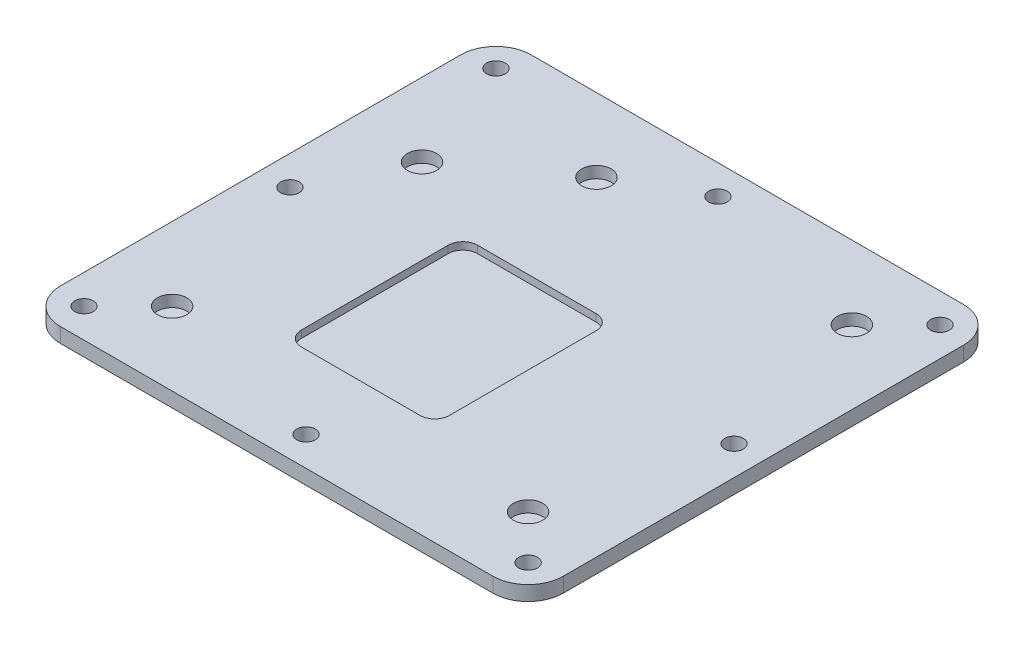
ISO-10303-21;
HEADER;
FILE_DESCRIPTION(('STEP AP214'),'2;1');
FILE_NAME('part.step','',(''),(''),'','','');
FILE_SCHEMA(('AUTOMOTIVE_DESIGN { 1 0 10303 214 1 1 1 1 }'));
ENDSEC;
DATA;
#1=APPLICATION_CONTEXT('core data for automotive mechanical design processes');
#2=APPLICATION_PROTOCOL_DEFINITION('international standard','automotive_design',2000,#1);
#3=PRODUCT_CONTEXT('',#1,'mechanical');
#4=PRODUCT('Part','Part','',(#3));
#5=PRODUCT_RELATED_PRODUCT_CATEGORY('part','',(#4));
#6=PRODUCT_DEFINITION_FORMATION('','',#4);
#7=PRODUCT_DEFINITION_CONTEXT('part definition',#1,'design');
#8=PRODUCT_DEFINITION('design','',#6,#7);
#9=PRODUCT_DEFINITION_SHAPE('','',#8);
#10=(LENGTH_UNIT() NAMED_UNIT(*) SI_UNIT(.MILLI.,.METRE.));
#11=(NAMED_UNIT(*) PLANE_ANGLE_UNIT() SI_UNIT($,.RADIAN.));
#12=(NAMED_UNIT(*) SI_UNIT($,.STERADIAN.) SOLID_ANGLE_UNIT());
#13=UNCERTAINTY_MEASURE_WITH_UNIT(LENGTH_MEASURE(1.E-05),#10,'distance_accuracy_value','');
#14=(GEOMETRIC_REPRESENTATION_CONTEXT(3) GLOBAL_UNCERTAINTY_ASSIGNED_CONTEXT((#13)) GLOBAL_UNIT_ASSIGNED_CONTEXT((#10,
#11,#12)) REPRESENTATION_CONTEXT('',''));
#15=CARTESIAN_POINT('',(0.,0.,0.));
#16=DIRECTION('',(0.,0.,1.));
#17=DIRECTION('',(1.,0.,0.));
#18=AXIS2_PLACEMENT_3D('',#15,#16,#17);
#19=CARTESIAN_POINT('',(0.,0.,0.));
#20=DIRECTION('',(0.,1.,0.));
#21=DIRECTION('',(0.,0.,1.));
#22=AXIS2_PLACEMENT_3D('',#19,#20,#21);
#23=PLANE('',#22);
#24=CARTESIAN_POINT('',(-48.006,0.,-44.5262));
#25=DIRECTION('',(0.,1.,0.));
#26=DIRECTION('',(0.,0.,1.));
#27=AXIS2_PLACEMENT_3D('',#24,#25,#26);
#28=CIRCLE('',#27,2.0193);
#29=CARTESIAN_POINT('',(-48.006,0.,-42.5069));
#30=VERTEX_POINT('',#29);
#31=EDGE_CURVE('E517',#30,#30,#28,.T.);
#32=ORIENTED_EDGE('',*,*,#31,.F.);
#33=EDGE_LOOP('',(#32));
#34=FACE_BOUND('',#33,.T.);
#35=CARTESIAN_POINT('',(48.006,0.,-44.5262));
#36=DIRECTION('',(0.,1.,0.));
#37=DIRECTION('',(0.,0.,1.));
#38=AXIS2_PLACEMENT_3D('',#35,#36,#37);
#39=CIRCLE('',#38,2.0193);
#40=CARTESIAN_POINT('',(48.006,0.,-42.5069));
#41=VERTEX_POINT('',#40);
#42=EDGE_CURVE('E512',#41,#41,#39,.T.);
#43=ORIENTED_EDGE('',*,*,#42,.F.);
#44=EDGE_LOOP('',(#43));
#45=FACE_BOUND('',#44,.T.);
#46=CARTESIAN_POINT('',(48.006,0.,44.5262));
#47=DIRECTION('',(0.,1.,0.));
#48=DIRECTION('',(0.,0.,1.));
#49=AXIS2_PLACEMENT_3D('',#46,#47,#48);
#50=CIRCLE('',#49,2.0193);
#51=CARTESIAN_POINT('',(48.006,0.,46.5455));
#52=VERTEX_POINT('',#51);
#53=EDGE_CURVE('E506',#52,#52,#50,.T.);
#54=ORIENTED_EDGE('',*,*,#53,.F.);
#55=EDGE_LOOP('',(#54));
#56=FACE_BOUND('',#55,.T.);
#57=CARTESIAN_POINT('',(-48.006,0.,44.5262));
#58=DIRECTION('',(0.,1.,0.));
#59=DIRECTION('',(0.,0.,1.));
#60=AXIS2_PLACEMENT_3D('',#57,#58,#59);
#61=CIRCLE('',#60,2.0193);
#62=CARTESIAN_POINT('',(-48.006,0.,46.5455));
#63=VERTEX_POINT('',#62);
#64=EDGE_CURVE('E500',#63,#63,#61,.T.);
#65=ORIENTED_EDGE('',*,*,#64,.F.);
#66=EDGE_LOOP('',(#65));
#67=FACE_BOUND('',#66,.T.);
#68=CARTESIAN_POINT('',(0.,0.,44.5262));
#69=DIRECTION('',(0.,1.,0.));
#70=DIRECTION('',(0.,0.,1.));
#71=AXIS2_PLACEMENT_3D('',#68,#69,#70);
#72=CIRCLE('',#71,2.0193);
#73=CARTESIAN_POINT('',(0.,0.,46.5455));
#74=VERTEX_POINT('',#73);
#75=EDGE_CURVE('E494',#74,#74,#72,.T.);
#76=ORIENTED_EDGE('',*,*,#75,.F.);
#77=EDGE_LOOP('',(#76));
#78=FACE_BOUND('',#77,.T.);
#79=CARTESIAN_POINT('',(-48.006,0.,0.));
#80=DIRECTION('',(0.,1.,0.));
#81=DIRECTION('',(0.,0.,1.));
#82=AXIS2_PLACEMENT_3D('',#79,#80,#81);
#83=CIRCLE('',#82,2.0193);
#84=CARTESIAN_POINT('',(-48.006,0.,2.0193));
#85=VERTEX_POINT('',#84);
#86=EDGE_CURVE('E488',#85,#85,#83,.T.);
#87=ORIENTED_EDGE('',*,*,#86,.F.);
#88=EDGE_LOOP('',(#87));
#89=FACE_BOUND('',#88,.T.);
#90=CARTESIAN_POINT('',(48.006,0.,0.));
#91=DIRECTION('',(0.,1.,0.));
#92=DIRECTION('',(0.,0.,1.));
#93=AXIS2_PLACEMENT_3D('',#90,#91,#92);
#94=CIRCLE('',#93,2.0193);
#95=CARTESIAN_POINT('',(48.006,0.,2.0193));
#96=VERTEX_POINT('',#95);
#97=EDGE_CURVE('E482',#96,#96,#94,.T.);
#98=ORIENTED_EDGE('',*,*,#97,.F.);
#99=EDGE_LOOP('',(#98));
#100=FACE_BOUND('',#99,.T.);
#101=CARTESIAN_POINT('',(0.,0.,-44.5262));
#102=DIRECTION('',(0.,1.,0.));
#103=DIRECTION('',(0.,0.,1.));
#104=AXIS2_PLACEMENT_3D('',#101,#102,#103);
#105=CIRCLE('',#104,2.0193);
#106=CARTESIAN_POINT('',(0.,0.,-42.5069));
#107=VERTEX_POINT('',#106);
#108=EDGE_CURVE('E476',#107,#107,#105,.T.);
#109=ORIENTED_EDGE('',*,*,#108,.F.);
#110=EDGE_LOOP('',(#109));
#111=FACE_BOUND('',#110,.T.);
#112=CARTESIAN_POINT('',(-38.481,0.,35.0012));
#113=DIRECTION('',(0.,1.,0.));
#114=DIRECTION('',(0.,0.,1.));
#115=AXIS2_PLACEMENT_3D('',#112,#113,#114);
#116=CIRCLE('',#115,3.175);
#117=CARTESIAN_POINT('',(-38.481,0.,38.1762));
#118=VERTEX_POINT('',#117);
#119=EDGE_CURVE('E450',#118,#118,#116,.T.);
#120=ORIENTED_EDGE('',*,*,#119,.F.);
#121=EDGE_LOOP('',(#120));
#122=FACE_BOUND('',#121,.T.);
#123=CARTESIAN_POINT('',(38.481,0.,35.0012));
#124=DIRECTION('',(0.,1.,0.));
#125=DIRECTION('',(0.,0.,1.));
#126=AXIS2_PLACEMENT_3D('',#123,#124,#125);
#127=CIRCLE('',#126,3.175);
#128=CARTESIAN_POINT('',(38.481,0.,38.1762));
#129=VERTEX_POINT('',#128);
#130=EDGE_CURVE('E457',#129,#129,#127,.T.);
#131=ORIENTED_EDGE('',*,*,#130,.F.);
#132=EDGE_LOOP('',(#131));
#133=FACE_BOUND('',#132,.T.);
#134=CARTESIAN_POINT('',(38.481,0.,-35.0012));
#135=DIRECTION('',(0.,1.,0.));
#136=DIRECTION('',(0.,0.,1.));
#137=AXIS2_PLACEMENT_3D('',#134,#135,#136);
#138=CIRCLE('',#137,3.175);
#139=CARTESIAN_POINT('',(38.481,0.,-31.8262));
#140=VERTEX_POINT('',#139);
#141=EDGE_CURVE('E463',#140,#140,#138,.T.);
#142=ORIENTED_EDGE('',*,*,#141,.F.);
#143=EDGE_LOOP('',(#142));
#144=FACE_BOUND('',#143,.T.);
#145=CARTESIAN_POINT('',(-16.7386,0.,-35.0012));
#146=DIRECTION('',(0.,1.,0.));
#147=DIRECTION('',(0.,0.,1.));
#148=AXIS2_PLACEMENT_3D('',#145,#146,#147);
#149=CIRCLE('',#148,3.175);
#150=CARTESIAN_POINT('',(-16.7386,0.,-31.8262));
#151=VERTEX_POINT('',#150);
#152=EDGE_CURVE('E469',#151,#151,#149,.T.);
#153=ORIENTED_EDGE('',*,*,#152,.F.);
#154=EDGE_LOOP('',(#153));
#155=FACE_BOUND('',#154,.T.);
#156=CARTESIAN_POINT('',(-38.481,0.,-19.0246));
#157=DIRECTION('',(0.,1.,0.));
#158=DIRECTION('',(0.,0.,1.));
#159=AXIS2_PLACEMENT_3D('',#156,#157,#158);
#160=CIRCLE('',#159,3.175);
#161=CARTESIAN_POINT('',(-38.481,0.,-15.8496));
#162=VERTEX_POINT('',#161);
#163=EDGE_CURVE('E444',#162,#162,#160,.T.);
#164=ORIENTED_EDGE('',*,*,#163,.F.);
#165=EDGE_LOOP('',(#164));
#166=FACE_BOUND('',#165,.T.);
#167=DIRECTION('',(-1.,0.,0.));
#168=VECTOR('',#167,1.);
#169=CARTESIAN_POINT('',(0.,0.,-50.8762));
#170=LINE('',#169,#168);
#171=CARTESIAN_POINT('',(46.736,0.,-50.8762));
#172=VERTEX_POINT('',#171);
#173=CARTESIAN_POINT('',(-46.736,0.,-50.8762));
#174=VERTEX_POINT('',#173);
#175=EDGE_CURVE('E225',#172,#174,#170,.T.);
#176=ORIENTED_EDGE('',*,*,#175,.T.);
#177=CARTESIAN_POINT('',(-46.736,0.,-43.2562));
#178=DIRECTION('',(0.,1.,0.));
#179=DIRECTION('',(0.,0.,1.));
#180=AXIS2_PLACEMENT_3D('',#177,#178,#179);
#181=CIRCLE('',#180,7.62);
#182=CARTESIAN_POINT('',(-54.356,0.,-43.2562));
#183=VERTEX_POINT('',#182);
#184=EDGE_CURVE('E232',#174,#183,#181,.T.);
#185=ORIENTED_EDGE('',*,*,#184,.T.);
#186=DIRECTION('',(0.,0.,-1.));
#187=VECTOR('',#186,1.);
#188=CARTESIAN_POINT('',(-54.356,0.,0.));
#189=LINE('',#188,#187);
#190=CARTESIAN_POINT('',(-54.356,0.,43.2562));
#191=VERTEX_POINT('',#190);
#192=EDGE_CURVE('E243',#191,#183,#189,.T.);
#193=ORIENTED_EDGE('',*,*,#192,.F.);
#194=CARTESIAN_POINT('',(-46.736,0.,43.2562));
#195=DIRECTION('',(0.,1.,0.));
#196=DIRECTION('',(0.,0.,1.));
#197=AXIS2_PLACEMENT_3D('',#194,#195,#196);
#198=CIRCLE('',#197,7.62);
#199=CARTESIAN_POINT('',(-46.736,0.,50.8762));
#200=VERTEX_POINT('',#199);
#201=EDGE_CURVE('E250',#191,#200,#198,.T.);
#202=ORIENTED_EDGE('',*,*,#201,.T.);
#203=DIRECTION('',(-1.,0.,0.));
#204=VECTOR('',#203,1.);
#205=CARTESIAN_POINT('',(0.,0.,50.8762));
#206=LINE('',#205,#204);
#207=CARTESIAN_POINT('',(46.736,0.,50.8762));
#208=VERTEX_POINT('',#207);
#209=EDGE_CURVE('E338',#208,#200,#206,.T.);
#210=ORIENTED_EDGE('',*,*,#209,.F.);
#211=CARTESIAN_POINT('',(46.736,0.,43.2562));
#212=DIRECTION('',(0.,1.,0.));
#213=DIRECTION('',(0.,0.,1.));
#214=AXIS2_PLACEMENT_3D('',#211,#212,#213);
#215=CIRCLE('',#214,7.62);
#216=CARTESIAN_POINT('',(54.356,0.,43.2562));
#217=VERTEX_POINT('',#216);
#218=EDGE_CURVE('E233',#208,#217,#215,.T.);
#219=ORIENTED_EDGE('',*,*,#218,.T.);
#220=DIRECTION('',(0.,0.,-1.));
#221=VECTOR('',#220,1.);
#222=CARTESIAN_POINT('',(54.356,0.,0.));
#223=LINE('',#222,#221);
#224=CARTESIAN_POINT('',(54.356,0.,-43.2562));
#225=VERTEX_POINT('',#224);
#226=EDGE_CURVE('E227',#217,#225,#223,.T.);
#227=ORIENTED_EDGE('',*,*,#226,.T.);
#228=CARTESIAN_POINT('',(46.736,0.,-43.2562));
#229=DIRECTION('',(0.,1.,0.));
#230=DIRECTION('',(0.,0.,1.));
#231=AXIS2_PLACEMENT_3D('',#228,#229,#230);
#232=CIRCLE('',#231,7.62);
#233=EDGE_CURVE('E223',#225,#172,#232,.T.);
#234=ORIENTED_EDGE('',*,*,#233,.T.);
#235=EDGE_LOOP('',(#176,#185,#193,#202,#210,#219,#227,#234));
#236=FACE_BOUND('',#235,.T.);
#237=DIRECTION('',(0.,0.,-1.));
#238=VECTOR('',#237,1.);
#239=CARTESIAN_POINT('',(11.938,0.,0.));
#240=LINE('',#239,#238);
#241=CARTESIAN_POINT('',(11.938,0.,25.4762));
#242=VERTEX_POINT('',#241);
#243=CARTESIAN_POINT('',(11.938,0.,-6.2738));
#244=VERTEX_POINT('',#243);
#245=EDGE_CURVE('E313',#242,#244,#240,.T.);
#246=ORIENTED_EDGE('',*,*,#245,.F.);
#247=CARTESIAN_POINT('',(8.763,0.,25.4762));
#248=DIRECTION('',(0.,1.,0.));
#249=DIRECTION('',(0.,0.,1.));
#250=AXIS2_PLACEMENT_3D('',#247,#248,#249);
#251=CIRCLE('',#250,3.175);
#252=CARTESIAN_POINT('',(8.763,0.,28.6512));
#253=VERTEX_POINT('',#252);
#254=EDGE_CURVE('E119',#242,#253,#251,.F.);
#255=ORIENTED_EDGE('',*,*,#254,.T.);
#256=DIRECTION('',(-1.,0.,0.));
#257=VECTOR('',#256,1.);
#258=CARTESIAN_POINT('',(0.,0.,28.6512));
#259=LINE('',#258,#257);
#260=CARTESIAN_POINT('',(-16.891,0.,28.6512));
#261=VERTEX_POINT('',#260);
#262=EDGE_CURVE('E324',#253,#261,#259,.T.);
#263=ORIENTED_EDGE('',*,*,#262,.T.);
#264=CARTESIAN_POINT('',(-16.891,0.,25.4762));
#265=DIRECTION('',(0.,1.,0.));
#266=DIRECTION('',(0.,0.,1.));
#267=AXIS2_PLACEMENT_3D('',#264,#265,#266);
#268=CIRCLE('',#267,3.175);
#269=CARTESIAN_POINT('',(-20.066,0.,25.4762));
#270=VERTEX_POINT('',#269);
#271=EDGE_CURVE('E12',#261,#270,#268,.F.);
#272=ORIENTED_EDGE('',*,*,#271,.T.);
#273=DIRECTION('',(0.,0.,-1.));
#274=VECTOR('',#273,1.);
#275=CARTESIAN_POINT('',(-20.066,0.,0.));
#276=LINE('',#275,#274);
#277=CARTESIAN_POINT('',(-20.066,0.,-6.2738));
#278=VERTEX_POINT('',#277);
#279=EDGE_CURVE('E346',#270,#278,#276,.T.);
#280=ORIENTED_EDGE('',*,*,#279,.T.);
#281=CARTESIAN_POINT('',(-16.891,0.,-6.2738));
#282=DIRECTION('',(0.,1.,0.));
#283=DIRECTION('',(0.,0.,1.));
#284=AXIS2_PLACEMENT_3D('',#281,#282,#283);
#285=CIRCLE('',#284,3.175);
#286=CARTESIAN_POINT('',(-16.891,0.,-9.4488));
#287=VERTEX_POINT('',#286);
#288=EDGE_CURVE('E308',#278,#287,#285,.F.);
#289=ORIENTED_EDGE('',*,*,#288,.T.);
#290=DIRECTION('',(-1.,0.,0.));
#291=VECTOR('',#290,1.);
#292=CARTESIAN_POINT('',(0.,0.,-9.4488));
#293=LINE('',#292,#291);
#294=CARTESIAN_POINT('',(8.763,0.,-9.4488));
#295=VERTEX_POINT('',#294);
#296=EDGE_CURVE('E315',#295,#287,#293,.T.);
#297=ORIENTED_EDGE('',*,*,#296,.F.);
#298=CARTESIAN_POINT('',(8.763,0.,-6.2738));
#299=DIRECTION('',(0.,1.,0.));
#300=DIRECTION('',(0.,0.,1.));
#301=AXIS2_PLACEMENT_3D('',#298,#299,#300);
#302=CIRCLE('',#301,3.175);
#303=EDGE_CURVE('E310',#295,#244,#302,.F.);
#304=ORIENTED_EDGE('',*,*,#303,.T.);
#305=EDGE_LOOP('',(#246,#255,#263,#272,#280,#289,#297,#304));
#306=FACE_BOUND('',#305,.T.);
#307=ADVANCED_FACE('F111',(#34,#45,#56,#67,#78,#89,#100,#111,#122,#133,#144,#155,#166,#236,
#306),#23,.T.);
#308=CARTESIAN_POINT('',(0.,-3.175,0.));
#309=DIRECTION('',(0.,1.,0.));
#310=DIRECTION('',(0.,0.,1.));
#311=AXIS2_PLACEMENT_3D('',#308,#309,#310);
#312=PLANE('',#311);
#313=CARTESIAN_POINT('',(-48.006,-3.175,-44.5262));
#314=DIRECTION('',(0.,1.,0.));
#315=DIRECTION('',(0.,0.,1.));
#316=AXIS2_PLACEMENT_3D('',#313,#314,#315);
#317=CIRCLE('',#316,2.0193);
#318=CARTESIAN_POINT('',(-48.006,-3.175,-42.5069));
#319=VERTEX_POINT('',#318);
#320=EDGE_CURVE('E515',#319,#319,#317,.T.);
#321=ORIENTED_EDGE('',*,*,#320,.T.);
#322=EDGE_LOOP('',(#321));
#323=FACE_BOUND('',#322,.T.);
#324=CARTESIAN_POINT('',(48.006,-3.175,-44.5262));
#325=DIRECTION('',(0.,1.,0.));
#326=DIRECTION('',(0.,0.,1.));
#327=AXIS2_PLACEMENT_3D('',#324,#325,#326);
#328=CIRCLE('',#327,2.0193);
#329=CARTESIAN_POINT('',(48.006,-3.175,-42.5069));
#330=VERTEX_POINT('',#329);
#331=EDGE_CURVE('E509',#330,#330,#328,.T.);
#332=ORIENTED_EDGE('',*,*,#331,.T.);
#333=EDGE_LOOP('',(#332));
#334=FACE_BOUND('',#333,.T.);
#335=CARTESIAN_POINT('',(48.006,-3.175,44.5262));
#336=DIRECTION('',(0.,1.,0.));
#337=DIRECTION('',(0.,0.,1.));
#338=AXIS2_PLACEMENT_3D('',#335,#336,#337);
#339=CIRCLE('',#338,2.0193);
#340=CARTESIAN_POINT('',(48.006,-3.175,46.5455));
#341=VERTEX_POINT('',#340);
#342=EDGE_CURVE('E503',#341,#341,#339,.T.);
#343=ORIENTED_EDGE('',*,*,#342,.T.);
#344=EDGE_LOOP('',(#343));
#345=FACE_BOUND('',#344,.T.);
#346=CARTESIAN_POINT('',(-48.006,-3.175,44.5262));
#347=DIRECTION('',(0.,1.,0.));
#348=DIRECTION('',(0.,0.,1.));
#349=AXIS2_PLACEMENT_3D('',#346,#347,#348);
#350=CIRCLE('',#349,2.0193);
#351=CARTESIAN_POINT('',(-48.006,-3.175,46.5455));
#352=VERTEX_POINT('',#351);
#353=EDGE_CURVE('E497',#352,#352,#350,.T.);
#354=ORIENTED_EDGE('',*,*,#353,.T.);
#355=EDGE_LOOP('',(#354));
#356=FACE_BOUND('',#355,.T.);
#357=CARTESIAN_POINT('',(0.,-3.175,44.5262));
#358=DIRECTION('',(0.,1.,0.));
#359=DIRECTION('',(0.,0.,1.));
#360=AXIS2_PLACEMENT_3D('',#357,#358,#359);
#361=CIRCLE('',#360,2.0193);
#362=CARTESIAN_POINT('',(0.,-3.175,46.5455));
#363=VERTEX_POINT('',#362);
#364=EDGE_CURVE('E491',#363,#363,#361,.T.);
#365=ORIENTED_EDGE('',*,*,#364,.T.);
#366=EDGE_LOOP('',(#365));
#367=FACE_BOUND('',#366,.T.);
#368=CARTESIAN_POINT('',(-48.006,-3.175,0.));
#369=DIRECTION('',(0.,1.,0.));
#370=DIRECTION('',(0.,0.,1.));
#371=AXIS2_PLACEMENT_3D('',#368,#369,#370);
#372=CIRCLE('',#371,2.0193);
#373=CARTESIAN_POINT('',(-48.006,-3.175,2.0193));
#374=VERTEX_POINT('',#373);
#375=EDGE_CURVE('E485',#374,#374,#372,.T.);
#376=ORIENTED_EDGE('',*,*,#375,.T.);
#377=EDGE_LOOP('',(#376));
#378=FACE_BOUND('',#377,.T.);
#379=CARTESIAN_POINT('',(48.006,-3.175,0.));
#380=DIRECTION('',(0.,1.,0.));
#381=DIRECTION('',(0.,0.,1.));
#382=AXIS2_PLACEMENT_3D('',#379,#380,#381);
#383=CIRCLE('',#382,2.0193);
#384=CARTESIAN_POINT('',(48.006,-3.175,2.0193));
#385=VERTEX_POINT('',#384);
#386=EDGE_CURVE('E479',#385,#385,#383,.T.);
#387=ORIENTED_EDGE('',*,*,#386,.T.);
#388=EDGE_LOOP('',(#387));
#389=FACE_BOUND('',#388,.T.);
#390=CARTESIAN_POINT('',(0.,-3.175,-44.5262));
#391=DIRECTION('',(0.,1.,0.));
#392=DIRECTION('',(0.,0.,1.));
#393=AXIS2_PLACEMENT_3D('',#390,#391,#392);
#394=CIRCLE('',#393,2.0193);
#395=CARTESIAN_POINT('',(0.,-3.175,-42.5069));
#396=VERTEX_POINT('',#395);
#397=EDGE_CURVE('E454',#396,#396,#394,.T.);
#398=ORIENTED_EDGE('',*,*,#397,.T.);
#399=EDGE_LOOP('',(#398));
#400=FACE_BOUND('',#399,.T.);
#401=DIRECTION('',(0.,0.,-1.));
#402=VECTOR('',#401,1.);
#403=CARTESIAN_POINT('',(-54.356,-3.175,0.));
#404=LINE('',#403,#402);
#405=CARTESIAN_POINT('',(-54.356,-3.175,43.2562));
#406=VERTEX_POINT('',#405);
#407=CARTESIAN_POINT('',(-54.356,-3.175,-43.2562));
#408=VERTEX_POINT('',#407);
#409=EDGE_CURVE('E248',#406,#408,#404,.T.);
#410=ORIENTED_EDGE('',*,*,#409,.T.);
#411=CARTESIAN_POINT('',(-46.736,-3.175,-43.2562));
#412=DIRECTION('',(0.,1.,0.));
#413=DIRECTION('',(0.,0.,1.));
#414=AXIS2_PLACEMENT_3D('',#411,#412,#413);
#415=CIRCLE('',#414,7.62);
#416=CARTESIAN_POINT('',(-46.736,-3.175,-50.8762));
#417=VERTEX_POINT('',#416);
#418=EDGE_CURVE('E270',#408,#417,#415,.F.);
#419=ORIENTED_EDGE('',*,*,#418,.T.);
#420=DIRECTION('',(-1.,0.,0.));
#421=VECTOR('',#420,1.);
#422=CARTESIAN_POINT('',(0.,-3.175,-50.8762));
#423=LINE('',#422,#421);
#424=CARTESIAN_POINT('',(46.736,-3.175,-50.8762));
#425=VERTEX_POINT('',#424);
#426=EDGE_CURVE('E253',#425,#417,#423,.T.);
#427=ORIENTED_EDGE('',*,*,#426,.F.);
#428=CARTESIAN_POINT('',(46.736,-3.175,-43.2562));
#429=DIRECTION('',(0.,1.,0.));
#430=DIRECTION('',(0.,0.,1.));
#431=AXIS2_PLACEMENT_3D('',#428,#429,#430);
#432=CIRCLE('',#431,7.62);
#433=CARTESIAN_POINT('',(54.356,-3.175,-43.2562));
#434=VERTEX_POINT('',#433);
#435=EDGE_CURVE('E247',#425,#434,#432,.F.);
#436=ORIENTED_EDGE('',*,*,#435,.T.);
#437=DIRECTION('',(0.,0.,-1.));
#438=VECTOR('',#437,1.);
#439=CARTESIAN_POINT('',(54.356,-3.175,0.));
#440=LINE('',#439,#438);
#441=CARTESIAN_POINT('',(54.356,-3.175,43.2562));
#442=VERTEX_POINT('',#441);
#443=EDGE_CURVE('E356',#442,#434,#440,.T.);
#444=ORIENTED_EDGE('',*,*,#443,.F.);
#445=CARTESIAN_POINT('',(46.736,-3.175,43.2562));
#446=DIRECTION('',(0.,1.,0.));
#447=DIRECTION('',(0.,0.,1.));
#448=AXIS2_PLACEMENT_3D('',#445,#446,#447);
#449=CIRCLE('',#448,7.62);
#450=CARTESIAN_POINT('',(46.736,-3.175,50.8762));
#451=VERTEX_POINT('',#450);
#452=EDGE_CURVE('E267',#442,#451,#449,.F.);
#453=ORIENTED_EDGE('',*,*,#452,.T.);
#454=DIRECTION('',(-1.,0.,0.));
#455=VECTOR('',#454,1.);
#456=CARTESIAN_POINT('',(0.,-3.175,50.8762));
#457=LINE('',#456,#455);
#458=CARTESIAN_POINT('',(-46.736,-3.175,50.8762));
#459=VERTEX_POINT('',#458);
#460=EDGE_CURVE('E353',#451,#459,#457,.T.);
#461=ORIENTED_EDGE('',*,*,#460,.T.);
#462=CARTESIAN_POINT('',(-46.736,-3.175,43.2562));
#463=DIRECTION('',(0.,1.,0.));
#464=DIRECTION('',(0.,0.,1.));
#465=AXIS2_PLACEMENT_3D('',#462,#463,#464);
#466=CIRCLE('',#465,7.62);
#467=EDGE_CURVE('E265',#459,#406,#466,.F.);
#468=ORIENTED_EDGE('',*,*,#467,.T.);
#469=EDGE_LOOP('',(#410,#419,#427,#436,#444,#453,#461,#468));
#470=FACE_BOUND('',#469,.T.);
#471=ADVANCED_FACE('F387',(#323,#334,#345,#356,#367,#378,#389,#400,#470),#312,.F.);
#472=CARTESIAN_POINT('',(-54.356,-3.175,0.));
#473=DIRECTION('',(1.,0.,0.));
#474=DIRECTION('',(0.,0.,-1.));
#475=AXIS2_PLACEMENT_3D('',#472,#473,#474);
#476=PLANE('',#475);
#477=ORIENTED_EDGE('',*,*,#192,.T.);
#478=DIRECTION('',(0.,1.,0.));
#479=VECTOR('',#478,1.);
#480=CARTESIAN_POINT('',(-54.356,-3.175,-43.2562));
#481=LINE('',#480,#479);
#482=EDGE_CURVE('E263',#183,#408,#481,.F.);
#483=ORIENTED_EDGE('',*,*,#482,.T.);
#484=ORIENTED_EDGE('',*,*,#409,.F.);
#485=DIRECTION('',(0.,1.,0.));
#486=VECTOR('',#485,1.);
#487=CARTESIAN_POINT('',(-54.356,-3.175,43.2562));
#488=LINE('',#487,#486);
#489=EDGE_CURVE('E260',#406,#191,#488,.T.);
#490=ORIENTED_EDGE('',*,*,#489,.T.);
#491=EDGE_LOOP('',(#477,#483,#484,#490));
#492=FACE_BOUND('',#491,.T.);
#493=ADVANCED_FACE('F368',(#492),#476,.F.);
#494=CARTESIAN_POINT('',(0.,-3.175,-50.8762));
#495=DIRECTION('',(0.,0.,-1.));
#496=DIRECTION('',(-1.,0.,0.));
#497=AXIS2_PLACEMENT_3D('',#494,#495,#496);
#498=PLANE('',#497);
#499=ORIENTED_EDGE('',*,*,#426,.T.);
#500=DIRECTION('',(0.,1.,0.));
#501=VECTOR('',#500,1.);
#502=CARTESIAN_POINT('',(-46.736,0.,-50.8762));
#503=LINE('',#502,#501);
#504=EDGE_CURVE('E242',#417,#174,#503,.T.);
#505=ORIENTED_EDGE('',*,*,#504,.T.);
#506=ORIENTED_EDGE('',*,*,#175,.F.);
#507=DIRECTION('',(0.,1.,0.));
#508=VECTOR('',#507,1.);
#509=CARTESIAN_POINT('',(46.736,-3.175,-50.8762));
#510=LINE('',#509,#508);
#511=EDGE_CURVE('E239',#172,#425,#510,.F.);
#512=ORIENTED_EDGE('',*,*,#511,.T.);
#513=EDGE_LOOP('',(#499,#505,#506,#512));
#514=FACE_BOUND('',#513,.T.);
#515=ADVANCED_FACE('F238',(#514),#498,.T.);
#516=CARTESIAN_POINT('',(54.356,-3.175,0.));
#517=DIRECTION('',(1.,0.,0.));
#518=DIRECTION('',(0.,0.,-1.));
#519=AXIS2_PLACEMENT_3D('',#516,#517,#518);
#520=PLANE('',#519);
#521=ORIENTED_EDGE('',*,*,#443,.T.);
#522=DIRECTION('',(0.,1.,0.));
#523=VECTOR('',#522,1.);
#524=CARTESIAN_POINT('',(54.356,-3.175,-43.2562));
#525=LINE('',#524,#523);
#526=EDGE_CURVE('E274',#434,#225,#525,.T.);
#527=ORIENTED_EDGE('',*,*,#526,.T.);
#528=ORIENTED_EDGE('',*,*,#226,.F.);
#529=DIRECTION('',(0.,1.,0.));
#530=VECTOR('',#529,1.);
#531=CARTESIAN_POINT('',(54.356,-3.175,43.2562));
#532=LINE('',#531,#530);
#533=EDGE_CURVE('E272',#217,#442,#532,.F.);
#534=ORIENTED_EDGE('',*,*,#533,.T.);
#535=EDGE_LOOP('',(#521,#527,#528,#534));
#536=FACE_BOUND('',#535,.T.);
#537=ADVANCED_FACE('F385',(#536),#520,.T.);
#538=CARTESIAN_POINT('',(0.,-3.175,50.8762));
#539=DIRECTION('',(0.,0.,-1.));
#540=DIRECTION('',(-1.,0.,0.));
#541=AXIS2_PLACEMENT_3D('',#538,#539,#540);
#542=PLANE('',#541);
#543=ORIENTED_EDGE('',*,*,#460,.F.);
#544=DIRECTION('',(0.,1.,0.));
#545=VECTOR('',#544,1.);
#546=CARTESIAN_POINT('',(46.736,0.,50.8762));
#547=LINE('',#546,#545);
#548=EDGE_CURVE('E278',#451,#208,#547,.T.);
#549=ORIENTED_EDGE('',*,*,#548,.T.);
#550=ORIENTED_EDGE('',*,*,#209,.T.);
#551=DIRECTION('',(0.,1.,0.));
#552=VECTOR('',#551,1.);
#553=CARTESIAN_POINT('',(-46.736,-3.175,50.8762));
#554=LINE('',#553,#552);
#555=EDGE_CURVE('E276',#200,#459,#554,.F.);
#556=ORIENTED_EDGE('',*,*,#555,.T.);
#557=EDGE_LOOP('',(#543,#549,#550,#556));
#558=FACE_BOUND('',#557,.T.);
#559=ADVANCED_FACE('F378',(#558),#542,.F.);
#560=CARTESIAN_POINT('',(-20.066,-1.5875,0.));
#561=DIRECTION('',(1.,0.,0.));
#562=DIRECTION('',(0.,0.,-1.));
#563=AXIS2_PLACEMENT_3D('',#560,#561,#562);
#564=PLANE('',#563);
#565=DIRECTION('',(0.,0.,-1.));
#566=VECTOR('',#565,1.);
#567=CARTESIAN_POINT('',(-20.066,-1.5875,0.));
#568=LINE('',#567,#566);
#569=CARTESIAN_POINT('',(-20.066,-1.5875,25.4762));
#570=VERTEX_POINT('',#569);
#571=CARTESIAN_POINT('',(-20.066,-1.5875,-6.2738));
#572=VERTEX_POINT('',#571);
#573=EDGE_CURVE('E352',#570,#572,#568,.T.);
#574=ORIENTED_EDGE('',*,*,#573,.T.);
#575=DIRECTION('',(0.,1.,0.));
#576=VECTOR('',#575,1.);
#577=CARTESIAN_POINT('',(-20.066,-1.5875,-6.2738));
#578=LINE('',#577,#576);
#579=EDGE_CURVE('E283',#572,#278,#578,.T.);
#580=ORIENTED_EDGE('',*,*,#579,.T.);
#581=ORIENTED_EDGE('',*,*,#279,.F.);
#582=DIRECTION('',(0.,1.,0.));
#583=VECTOR('',#582,1.);
#584=CARTESIAN_POINT('',(-20.066,-1.5875,25.4762));
#585=LINE('',#584,#583);
#586=EDGE_CURVE('E281',#270,#570,#585,.F.);
#587=ORIENTED_EDGE('',*,*,#586,.T.);
#588=EDGE_LOOP('',(#574,#580,#581,#587));
#589=FACE_BOUND('',#588,.T.);
#590=ADVANCED_FACE('F391',(#589),#564,.T.);
#591=CARTESIAN_POINT('',(0.,-1.5875,-9.4488));
#592=DIRECTION('',(0.,0.,-1.));
#593=DIRECTION('',(-1.,0.,0.));
#594=AXIS2_PLACEMENT_3D('',#591,#592,#593);
#595=PLANE('',#594);
#596=ORIENTED_EDGE('',*,*,#296,.T.);
#597=DIRECTION('',(0.,1.,0.));
#598=VECTOR('',#597,1.);
#599=CARTESIAN_POINT('',(-16.891,-1.5875,-9.4488));
#600=LINE('',#599,#598);
#601=CARTESIAN_POINT('',(-16.891,-1.5875,-9.4488));
#602=VERTEX_POINT('',#601);
#603=EDGE_CURVE('E289',#287,#602,#600,.F.);
#604=ORIENTED_EDGE('',*,*,#603,.T.);
#605=DIRECTION('',(-1.,0.,0.));
#606=VECTOR('',#605,1.);
#607=CARTESIAN_POINT('',(0.,-1.5875,-9.4488));
#608=LINE('',#607,#606);
#609=CARTESIAN_POINT('',(8.763,-1.5875,-9.4488));
#610=VERTEX_POINT('',#609);
#611=EDGE_CURVE('E332',#610,#602,#608,.T.);
#612=ORIENTED_EDGE('',*,*,#611,.F.);
#613=DIRECTION('',(0.,1.,0.));
#614=VECTOR('',#613,1.);
#615=CARTESIAN_POINT('',(8.763,0.,-9.4488));
#616=LINE('',#615,#614);
#617=EDGE_CURVE('E286',#610,#295,#616,.T.);
#618=ORIENTED_EDGE('',*,*,#617,.T.);
#619=EDGE_LOOP('',(#596,#604,#612,#618));
#620=FACE_BOUND('',#619,.T.);
#621=ADVANCED_FACE('F336',(#620),#595,.F.);
#622=CARTESIAN_POINT('',(11.938,-1.5875,0.));
#623=DIRECTION('',(1.,0.,0.));
#624=DIRECTION('',(0.,0.,-1.));
#625=AXIS2_PLACEMENT_3D('',#622,#623,#624);
#626=PLANE('',#625);
#627=ORIENTED_EDGE('',*,*,#245,.T.);
#628=DIRECTION('',(0.,1.,0.));
#629=VECTOR('',#628,1.);
#630=CARTESIAN_POINT('',(11.938,-1.5875,-6.2738));
#631=LINE('',#630,#629);
#632=CARTESIAN_POINT('',(11.938,-1.5875,-6.2738));
#633=VERTEX_POINT('',#632);
#634=EDGE_CURVE('E302',#244,#633,#631,.F.);
#635=ORIENTED_EDGE('',*,*,#634,.T.);
#636=DIRECTION('',(0.,0.,-1.));
#637=VECTOR('',#636,1.);
#638=CARTESIAN_POINT('',(11.938,-1.5875,0.));
#639=LINE('',#638,#637);
#640=CARTESIAN_POINT('',(11.938,-1.5875,25.4762));
#641=VERTEX_POINT('',#640);
#642=EDGE_CURVE('E334',#641,#633,#639,.T.);
#643=ORIENTED_EDGE('',*,*,#642,.F.);
#644=DIRECTION('',(0.,1.,0.));
#645=VECTOR('',#644,1.);
#646=CARTESIAN_POINT('',(11.938,-1.5875,25.4762));
#647=LINE('',#646,#645);
#648=EDGE_CURVE('E299',#641,#242,#647,.T.);
#649=ORIENTED_EDGE('',*,*,#648,.T.);
#650=EDGE_LOOP('',(#627,#635,#643,#649));
#651=FACE_BOUND('',#650,.T.);
#652=ADVANCED_FACE('F320',(#651),#626,.F.);
#653=CARTESIAN_POINT('',(0.,-1.5875,28.6512));
#654=DIRECTION('',(0.,0.,-1.));
#655=DIRECTION('',(-1.,0.,0.));
#656=AXIS2_PLACEMENT_3D('',#653,#654,#655);
#657=PLANE('',#656);
#658=ORIENTED_EDGE('',*,*,#262,.F.);
#659=DIRECTION('',(0.,1.,0.));
#660=VECTOR('',#659,1.);
#661=CARTESIAN_POINT('',(8.763,-1.5875,28.6512));
#662=LINE('',#661,#660);
#663=CARTESIAN_POINT('',(8.763,-1.5875,28.6512));
#664=VERTEX_POINT('',#663);
#665=EDGE_CURVE('E306',#253,#664,#662,.F.);
#666=ORIENTED_EDGE('',*,*,#665,.T.);
#667=DIRECTION('',(-1.,0.,0.));
#668=VECTOR('',#667,1.);
#669=CARTESIAN_POINT('',(0.,-1.5875,28.6512));
#670=LINE('',#669,#668);
#671=CARTESIAN_POINT('',(-16.891,-1.5875,28.6512));
#672=VERTEX_POINT('',#671);
#673=EDGE_CURVE('E342',#664,#672,#670,.T.);
#674=ORIENTED_EDGE('',*,*,#673,.T.);
#675=DIRECTION('',(0.,1.,0.));
#676=VECTOR('',#675,1.);
#677=CARTESIAN_POINT('',(-16.891,0.,28.6512));
#678=LINE('',#677,#676);
#679=EDGE_CURVE('E304',#672,#261,#678,.T.);
#680=ORIENTED_EDGE('',*,*,#679,.T.);
#681=EDGE_LOOP('',(#658,#666,#674,#680));
#682=FACE_BOUND('',#681,.T.);
#683=ADVANCED_FACE('F558',(#682),#657,.T.);
#684=CARTESIAN_POINT('',(0.,-1.5875,0.));
#685=DIRECTION('',(0.,1.,0.));
#686=DIRECTION('',(0.,0.,1.));
#687=AXIS2_PLACEMENT_3D('',#684,#685,#686);
#688=PLANE('',#687);
#689=ORIENTED_EDGE('',*,*,#611,.T.);
#690=CARTESIAN_POINT('',(-16.891,-1.5875,-6.2738));
#691=DIRECTION('',(0.,1.,0.));
#692=DIRECTION('',(0.,0.,1.));
#693=AXIS2_PLACEMENT_3D('',#690,#691,#692);
#694=CIRCLE('',#693,3.175);
#695=EDGE_CURVE('E297',#602,#572,#694,.T.);
#696=ORIENTED_EDGE('',*,*,#695,.T.);
#697=ORIENTED_EDGE('',*,*,#573,.F.);
#698=CARTESIAN_POINT('',(-16.891,-1.5875,25.4762));
#699=DIRECTION('',(0.,1.,0.));
#700=DIRECTION('',(0.,0.,1.));
#701=AXIS2_PLACEMENT_3D('',#698,#699,#700);
#702=CIRCLE('',#701,3.175);
#703=EDGE_CURVE('E291',#570,#672,#702,.T.);
#704=ORIENTED_EDGE('',*,*,#703,.T.);
#705=ORIENTED_EDGE('',*,*,#673,.F.);
#706=CARTESIAN_POINT('',(8.763,-1.5875,25.4762));
#707=DIRECTION('',(0.,1.,0.));
#708=DIRECTION('',(0.,0.,1.));
#709=AXIS2_PLACEMENT_3D('',#706,#707,#708);
#710=CIRCLE('',#709,3.175);
#711=EDGE_CURVE('E293',#664,#641,#710,.T.);
#712=ORIENTED_EDGE('',*,*,#711,.T.);
#713=ORIENTED_EDGE('',*,*,#642,.T.);
#714=CARTESIAN_POINT('',(8.763,-1.5875,-6.2738));
#715=DIRECTION('',(0.,1.,0.));
#716=DIRECTION('',(0.,0.,1.));
#717=AXIS2_PLACEMENT_3D('',#714,#715,#716);
#718=CIRCLE('',#717,3.175);
#719=EDGE_CURVE('E295',#633,#610,#718,.T.);
#720=ORIENTED_EDGE('',*,*,#719,.T.);
#721=EDGE_LOOP('',(#689,#696,#697,#704,#705,#712,#713,#720));
#722=FACE_BOUND('',#721,.T.);
#723=ADVANCED_FACE('F331',(#722),#688,.T.);
#724=CARTESIAN_POINT('',(-38.481,-2.5,-19.0246));
#725=DIRECTION('',(0.,1.,0.));
#726=DIRECTION('',(0.,0.,1.));
#727=AXIS2_PLACEMENT_3D('',#724,#725,#726);
#728=CYLINDRICAL_SURFACE('',#727,3.175);
#729=CARTESIAN_POINT('',(-38.481,-2.5,-19.0246));
#730=DIRECTION('',(0.,1.,0.));
#731=DIRECTION('',(0.,0.,1.));
#732=AXIS2_PLACEMENT_3D('',#729,#730,#731);
#733=CIRCLE('',#732,3.175);
#734=CARTESIAN_POINT('',(-38.481,-2.5,-15.8496));
#735=VERTEX_POINT('',#734);
#736=EDGE_CURVE('E349',#735,#735,#733,.T.);
#737=ORIENTED_EDGE('',*,*,#736,.F.);
#738=EDGE_LOOP('',(#737));
#739=FACE_BOUND('',#738,.T.);
#740=ORIENTED_EDGE('',*,*,#163,.T.);
#741=EDGE_LOOP('',(#740));
#742=FACE_BOUND('',#741,.T.);
#743=ADVANCED_FACE('F546',(#739,#742),#728,.F.);
#744=CARTESIAN_POINT('',(-38.481,-2.5,-19.0246));
#745=DIRECTION('',(0.,1.,0.));
#746=DIRECTION('',(0.,0.,1.));
#747=AXIS2_PLACEMENT_3D('',#744,#745,#746);
#748=PLANE('',#747);
#749=ORIENTED_EDGE('',*,*,#736,.T.);
#750=EDGE_LOOP('',(#749));
#751=FACE_BOUND('',#750,.T.);
#752=ADVANCED_FACE('F548',(#751),#748,.T.);
#753=CARTESIAN_POINT('',(-16.7386,-2.5,-35.0012));
#754=DIRECTION('',(0.,1.,0.));
#755=DIRECTION('',(0.,0.,1.));
#756=AXIS2_PLACEMENT_3D('',#753,#754,#755);
#757=CYLINDRICAL_SURFACE('',#756,3.175);
#758=CARTESIAN_POINT('',(-16.7386,-2.5,-35.0012));
#759=DIRECTION('',(0.,1.,0.));
#760=DIRECTION('',(0.,0.,1.));
#761=AXIS2_PLACEMENT_3D('',#758,#759,#760);
#762=CIRCLE('',#761,3.175);
#763=CARTESIAN_POINT('',(-16.7386,-2.5,-31.8262));
#764=VERTEX_POINT('',#763);
#765=EDGE_CURVE('E447',#764,#764,#762,.T.);
#766=ORIENTED_EDGE('',*,*,#765,.F.);
#767=EDGE_LOOP('',(#766));
#768=FACE_BOUND('',#767,.T.);
#769=ORIENTED_EDGE('',*,*,#152,.T.);
#770=EDGE_LOOP('',(#769));
#771=FACE_BOUND('',#770,.T.);
#772=ADVANCED_FACE('F555',(#768,#771),#757,.F.);
#773=CARTESIAN_POINT('',(-16.7386,-2.5,-35.0012));
#774=DIRECTION('',(0.,1.,0.));
#775=DIRECTION('',(0.,0.,1.));
#776=AXIS2_PLACEMENT_3D('',#773,#774,#775);
#777=PLANE('',#776);
#778=ORIENTED_EDGE('',*,*,#765,.T.);
#779=EDGE_LOOP('',(#778));
#780=FACE_BOUND('',#779,.T.);
#781=ADVANCED_FACE('F729',(#780),#777,.T.);
#782=CARTESIAN_POINT('',(38.481,-2.5,-35.0012));
#783=DIRECTION('',(0.,1.,0.));
#784=DIRECTION('',(0.,0.,1.));
#785=AXIS2_PLACEMENT_3D('',#782,#783,#784);
#786=CYLINDRICAL_SURFACE('',#785,3.175);
#787=CARTESIAN_POINT('',(38.481,-2.5,-35.0012));
#788=DIRECTION('',(0.,1.,0.));
#789=DIRECTION('',(0.,0.,1.));
#790=AXIS2_PLACEMENT_3D('',#787,#788,#789);
#791=CIRCLE('',#790,3.175);
#792=CARTESIAN_POINT('',(38.481,-2.5,-31.8262));
#793=VERTEX_POINT('',#792);
#794=EDGE_CURVE('E466',#793,#793,#791,.T.);
#795=ORIENTED_EDGE('',*,*,#794,.F.);
#796=EDGE_LOOP('',(#795));
#797=FACE_BOUND('',#796,.T.);
#798=ORIENTED_EDGE('',*,*,#141,.T.);
#799=EDGE_LOOP('',(#798));
#800=FACE_BOUND('',#799,.T.);
#801=ADVANCED_FACE('F721',(#797,#800),#786,.F.);
#802=CARTESIAN_POINT('',(38.481,-2.5,-35.0012));
#803=DIRECTION('',(0.,1.,0.));
#804=DIRECTION('',(0.,0.,1.));
#805=AXIS2_PLACEMENT_3D('',#802,#803,#804);
#806=PLANE('',#805);
#807=ORIENTED_EDGE('',*,*,#794,.T.);
#808=EDGE_LOOP('',(#807));
#809=FACE_BOUND('',#808,.T.);
#810=ADVANCED_FACE('F713',(#809),#806,.T.);
#811=CARTESIAN_POINT('',(38.481,-2.5,35.0012));
#812=DIRECTION('',(0.,1.,0.));
#813=DIRECTION('',(0.,0.,1.));
#814=AXIS2_PLACEMENT_3D('',#811,#812,#813);
#815=CYLINDRICAL_SURFACE('',#814,3.175);
#816=CARTESIAN_POINT('',(38.481,-2.5,35.0012));
#817=DIRECTION('',(0.,1.,0.));
#818=DIRECTION('',(0.,0.,1.));
#819=AXIS2_PLACEMENT_3D('',#816,#817,#818);
#820=CIRCLE('',#819,3.175);
#821=CARTESIAN_POINT('',(38.481,-2.5,38.1762));
#822=VERTEX_POINT('',#821);
#823=EDGE_CURVE('E460',#822,#822,#820,.T.);
#824=ORIENTED_EDGE('',*,*,#823,.F.);
#825=EDGE_LOOP('',(#824));
#826=FACE_BOUND('',#825,.T.);
#827=ORIENTED_EDGE('',*,*,#130,.T.);
#828=EDGE_LOOP('',(#827));
#829=FACE_BOUND('',#828,.T.);
#830=ADVANCED_FACE('F705',(#826,#829),#815,.F.);
#831=CARTESIAN_POINT('',(38.481,-2.5,35.0012));
#832=DIRECTION('',(0.,1.,0.));
#833=DIRECTION('',(0.,0.,1.));
#834=AXIS2_PLACEMENT_3D('',#831,#832,#833);
#835=PLANE('',#834);
#836=ORIENTED_EDGE('',*,*,#823,.T.);
#837=EDGE_LOOP('',(#836));
#838=FACE_BOUND('',#837,.T.);
#839=ADVANCED_FACE('F698',(#838),#835,.T.);
#840=CARTESIAN_POINT('',(-38.481,-2.5,35.0012));
#841=DIRECTION('',(0.,1.,0.));
#842=DIRECTION('',(0.,0.,1.));
#843=AXIS2_PLACEMENT_3D('',#840,#841,#842);
#844=CYLINDRICAL_SURFACE('',#843,3.175);
#845=CARTESIAN_POINT('',(-38.481,-2.5,35.0012));
#846=DIRECTION('',(0.,1.,0.));
#847=DIRECTION('',(0.,0.,1.));
#848=AXIS2_PLACEMENT_3D('',#845,#846,#847);
#849=CIRCLE('',#848,3.175);
#850=CARTESIAN_POINT('',(-38.481,-2.5,38.1762));
#851=VERTEX_POINT('',#850);
#852=EDGE_CURVE('E453',#851,#851,#849,.T.);
#853=ORIENTED_EDGE('',*,*,#852,.F.);
#854=EDGE_LOOP('',(#853));
#855=FACE_BOUND('',#854,.T.);
#856=ORIENTED_EDGE('',*,*,#119,.T.);
#857=EDGE_LOOP('',(#856));
#858=FACE_BOUND('',#857,.T.);
#859=ADVANCED_FACE('F689',(#855,#858),#844,.F.);
#860=CARTESIAN_POINT('',(-38.481,-2.5,35.0012));
#861=DIRECTION('',(0.,1.,0.));
#862=DIRECTION('',(0.,0.,1.));
#863=AXIS2_PLACEMENT_3D('',#860,#861,#862);
#864=PLANE('',#863);
#865=ORIENTED_EDGE('',*,*,#852,.T.);
#866=EDGE_LOOP('',(#865));
#867=FACE_BOUND('',#866,.T.);
#868=ADVANCED_FACE('F414',(#867),#864,.T.);
#869=CARTESIAN_POINT('',(-46.736,-3.175,-43.2562));
#870=DIRECTION('',(0.,-1.,0.));
#871=DIRECTION('',(0.,0.,-1.));
#872=AXIS2_PLACEMENT_3D('',#869,#870,#871);
#873=CYLINDRICAL_SURFACE('',#872,7.62);
#874=ORIENTED_EDGE('',*,*,#418,.F.);
#875=ORIENTED_EDGE('',*,*,#482,.F.);
#876=ORIENTED_EDGE('',*,*,#184,.F.);
#877=ORIENTED_EDGE('',*,*,#504,.F.);
#878=EDGE_LOOP('',(#874,#875,#876,#877));
#879=FACE_BOUND('',#878,.T.);
#880=ADVANCED_FACE('F363',(#879),#873,.T.);
#881=CARTESIAN_POINT('',(46.736,-3.175,-43.2562));
#882=DIRECTION('',(0.,1.,0.));
#883=DIRECTION('',(0.,0.,1.));
#884=AXIS2_PLACEMENT_3D('',#881,#882,#883);
#885=CYLINDRICAL_SURFACE('',#884,7.62);
#886=ORIENTED_EDGE('',*,*,#435,.F.);
#887=ORIENTED_EDGE('',*,*,#511,.F.);
#888=ORIENTED_EDGE('',*,*,#233,.F.);
#889=ORIENTED_EDGE('',*,*,#526,.F.);
#890=EDGE_LOOP('',(#886,#887,#888,#889));
#891=FACE_BOUND('',#890,.T.);
#892=ADVANCED_FACE('F246',(#891),#885,.T.);
#893=CARTESIAN_POINT('',(46.736,-3.175,43.2562));
#894=DIRECTION('',(0.,-1.,0.));
#895=DIRECTION('',(0.,0.,-1.));
#896=AXIS2_PLACEMENT_3D('',#893,#894,#895);
#897=CYLINDRICAL_SURFACE('',#896,7.62);
#898=ORIENTED_EDGE('',*,*,#452,.F.);
#899=ORIENTED_EDGE('',*,*,#533,.F.);
#900=ORIENTED_EDGE('',*,*,#218,.F.);
#901=ORIENTED_EDGE('',*,*,#548,.F.);
#902=EDGE_LOOP('',(#898,#899,#900,#901));
#903=FACE_BOUND('',#902,.T.);
#904=ADVANCED_FACE('F382',(#903),#897,.T.);
#905=CARTESIAN_POINT('',(-46.736,-3.175,43.2562));
#906=DIRECTION('',(0.,1.,0.));
#907=DIRECTION('',(0.,0.,1.));
#908=AXIS2_PLACEMENT_3D('',#905,#906,#907);
#909=CYLINDRICAL_SURFACE('',#908,7.62);
#910=ORIENTED_EDGE('',*,*,#467,.F.);
#911=ORIENTED_EDGE('',*,*,#555,.F.);
#912=ORIENTED_EDGE('',*,*,#201,.F.);
#913=ORIENTED_EDGE('',*,*,#489,.F.);
#914=EDGE_LOOP('',(#910,#911,#912,#913));
#915=FACE_BOUND('',#914,.T.);
#916=ADVANCED_FACE('F373',(#915),#909,.T.);
#917=CARTESIAN_POINT('',(0.,0.,-44.5262));
#918=DIRECTION('',(0.,1.,0.));
#919=DIRECTION('',(0.,0.,1.));
#920=AXIS2_PLACEMENT_3D('',#917,#918,#919);
#921=CYLINDRICAL_SURFACE('',#920,2.0193);
#922=ORIENTED_EDGE('',*,*,#397,.F.);
#923=EDGE_LOOP('',(#922));
#924=FACE_BOUND('',#923,.T.);
#925=ORIENTED_EDGE('',*,*,#108,.T.);
#926=EDGE_LOOP('',(#925));
#927=FACE_BOUND('',#926,.T.);
#928=ADVANCED_FACE('F421',(#924,#927),#921,.F.);
#929=CARTESIAN_POINT('',(48.006,0.,0.));
#930=DIRECTION('',(0.,1.,0.));
#931=DIRECTION('',(0.,0.,1.));
#932=AXIS2_PLACEMENT_3D('',#929,#930,#931);
#933=CYLINDRICAL_SURFACE('',#932,2.0193);
#934=ORIENTED_EDGE('',*,*,#386,.F.);
#935=EDGE_LOOP('',(#934));
#936=FACE_BOUND('',#935,.T.);
#937=ORIENTED_EDGE('',*,*,#97,.T.);
#938=EDGE_LOOP('',(#937));
#939=FACE_BOUND('',#938,.T.);
#940=ADVANCED_FACE('F650',(#936,#939),#933,.F.);
#941=CARTESIAN_POINT('',(-48.006,0.,0.));
#942=DIRECTION('',(0.,1.,0.));
#943=DIRECTION('',(0.,0.,1.));
#944=AXIS2_PLACEMENT_3D('',#941,#942,#943);
#945=CYLINDRICAL_SURFACE('',#944,2.0193);
#946=ORIENTED_EDGE('',*,*,#375,.F.);
#947=EDGE_LOOP('',(#946));
#948=FACE_BOUND('',#947,.T.);
#949=ORIENTED_EDGE('',*,*,#86,.T.);
#950=EDGE_LOOP('',(#949));
#951=FACE_BOUND('',#950,.T.);
#952=ADVANCED_FACE('F642',(#948,#951),#945,.F.);
#953=CARTESIAN_POINT('',(0.,0.,44.5262));
#954=DIRECTION('',(0.,1.,0.));
#955=DIRECTION('',(0.,0.,1.));
#956=AXIS2_PLACEMENT_3D('',#953,#954,#955);
#957=CYLINDRICAL_SURFACE('',#956,2.0193);
#958=ORIENTED_EDGE('',*,*,#364,.F.);
#959=EDGE_LOOP('',(#958));
#960=FACE_BOUND('',#959,.T.);
#961=ORIENTED_EDGE('',*,*,#75,.T.);
#962=EDGE_LOOP('',(#961));
#963=FACE_BOUND('',#962,.T.);
#964=ADVANCED_FACE('F634',(#960,#963),#957,.F.);
#965=CARTESIAN_POINT('',(-48.006,0.,44.5262));
#966=DIRECTION('',(0.,1.,0.));
#967=DIRECTION('',(0.,0.,1.));
#968=AXIS2_PLACEMENT_3D('',#965,#966,#967);
#969=CYLINDRICAL_SURFACE('',#968,2.0193);
#970=ORIENTED_EDGE('',*,*,#353,.F.);
#971=EDGE_LOOP('',(#970));
#972=FACE_BOUND('',#971,.T.);
#973=ORIENTED_EDGE('',*,*,#64,.T.);
#974=EDGE_LOOP('',(#973));
#975=FACE_BOUND('',#974,.T.);
#976=ADVANCED_FACE('F626',(#972,#975),#969,.F.);
#977=CARTESIAN_POINT('',(48.006,0.,44.5262));
#978=DIRECTION('',(0.,1.,0.));
#979=DIRECTION('',(0.,0.,1.));
#980=AXIS2_PLACEMENT_3D('',#977,#978,#979);
#981=CYLINDRICAL_SURFACE('',#980,2.0193);
#982=ORIENTED_EDGE('',*,*,#342,.F.);
#983=EDGE_LOOP('',(#982));
#984=FACE_BOUND('',#983,.T.);
#985=ORIENTED_EDGE('',*,*,#53,.T.);
#986=EDGE_LOOP('',(#985));
#987=FACE_BOUND('',#986,.T.);
#988=ADVANCED_FACE('F618',(#984,#987),#981,.F.);
#989=CARTESIAN_POINT('',(48.006,0.,-44.5262));
#990=DIRECTION('',(0.,1.,0.));
#991=DIRECTION('',(0.,0.,1.));
#992=AXIS2_PLACEMENT_3D('',#989,#990,#991);
#993=CYLINDRICAL_SURFACE('',#992,2.0193);
#994=ORIENTED_EDGE('',*,*,#331,.F.);
#995=EDGE_LOOP('',(#994));
#996=FACE_BOUND('',#995,.T.);
#997=ORIENTED_EDGE('',*,*,#42,.T.);
#998=EDGE_LOOP('',(#997));
#999=FACE_BOUND('',#998,.T.);
#1000=ADVANCED_FACE('F610',(#996,#999),#993,.F.);
#1001=CARTESIAN_POINT('',(-48.006,0.,-44.5262));
#1002=DIRECTION('',(0.,1.,0.));
#1003=DIRECTION('',(0.,0.,1.));
#1004=AXIS2_PLACEMENT_3D('',#1001,#1002,#1003);
#1005=CYLINDRICAL_SURFACE('',#1004,2.0193);
#1006=ORIENTED_EDGE('',*,*,#320,.F.);
#1007=EDGE_LOOP('',(#1006));
#1008=FACE_BOUND('',#1007,.T.);
#1009=ORIENTED_EDGE('',*,*,#31,.T.);
#1010=EDGE_LOOP('',(#1009));
#1011=FACE_BOUND('',#1010,.T.);
#1012=ADVANCED_FACE('F425',(#1008,#1011),#1005,.F.);
#1013=CARTESIAN_POINT('',(-16.891,-1.5875,-6.2738));
#1014=DIRECTION('',(0.,1.,0.));
#1015=DIRECTION('',(0.,0.,1.));
#1016=AXIS2_PLACEMENT_3D('',#1013,#1014,#1015);
#1017=CYLINDRICAL_SURFACE('',#1016,3.175);
#1018=ORIENTED_EDGE('',*,*,#695,.F.);
#1019=ORIENTED_EDGE('',*,*,#603,.F.);
#1020=ORIENTED_EDGE('',*,*,#288,.F.);
#1021=ORIENTED_EDGE('',*,*,#579,.F.);
#1022=EDGE_LOOP('',(#1018,#1019,#1020,#1021));
#1023=FACE_BOUND('',#1022,.T.);
#1024=ADVANCED_FACE('F422',(#1023),#1017,.F.);
#1025=CARTESIAN_POINT('',(8.763,-1.5875,-6.2738));
#1026=DIRECTION('',(0.,-1.,0.));
#1027=DIRECTION('',(0.,0.,-1.));
#1028=AXIS2_PLACEMENT_3D('',#1025,#1026,#1027);
#1029=CYLINDRICAL_SURFACE('',#1028,3.175);
#1030=ORIENTED_EDGE('',*,*,#719,.F.);
#1031=ORIENTED_EDGE('',*,*,#634,.F.);
#1032=ORIENTED_EDGE('',*,*,#303,.F.);
#1033=ORIENTED_EDGE('',*,*,#617,.F.);
#1034=EDGE_LOOP('',(#1030,#1031,#1032,#1033));
#1035=FACE_BOUND('',#1034,.T.);
#1036=ADVANCED_FACE('F327',(#1035),#1029,.F.);
#1037=CARTESIAN_POINT('',(8.763,-1.5875,25.4762));
#1038=DIRECTION('',(0.,1.,0.));
#1039=DIRECTION('',(0.,0.,1.));
#1040=AXIS2_PLACEMENT_3D('',#1037,#1038,#1039);
#1041=CYLINDRICAL_SURFACE('',#1040,3.175);
#1042=ORIENTED_EDGE('',*,*,#711,.F.);
#1043=ORIENTED_EDGE('',*,*,#665,.F.);
#1044=ORIENTED_EDGE('',*,*,#254,.F.);
#1045=ORIENTED_EDGE('',*,*,#648,.F.);
#1046=EDGE_LOOP('',(#1042,#1043,#1044,#1045));
#1047=FACE_BOUND('',#1046,.T.);
#1048=ADVANCED_FACE('F428',(#1047),#1041,.F.);
#1049=CARTESIAN_POINT('',(-16.891,-1.5875,25.4762));
#1050=DIRECTION('',(0.,-1.,0.));
#1051=DIRECTION('',(0.,0.,-1.));
#1052=AXIS2_PLACEMENT_3D('',#1049,#1050,#1051);
#1053=CYLINDRICAL_SURFACE('',#1052,3.175);
#1054=ORIENTED_EDGE('',*,*,#703,.F.);
#1055=ORIENTED_EDGE('',*,*,#586,.F.);
#1056=ORIENTED_EDGE('',*,*,#271,.F.);
#1057=ORIENTED_EDGE('',*,*,#679,.F.);
#1058=EDGE_LOOP('',(#1054,#1055,#1056,#1057));
#1059=FACE_BOUND('',#1058,.T.);
#1060=ADVANCED_FACE('F113',(#1059),#1053,.F.);
#1061=CLOSED_SHELL('',(#307,#471,#493,#515,#537,#559,#590,#621,#652,#683,#723,#743,#752,#772,
#781,#801,#810,#830,#839,#859,#868,#880,#892,#904,#916,#928,#940,#952,#964,#976,#988,#1000,
#1012,#1024,#1036,#1048,#1060));
#1062=MANIFOLD_SOLID_BREP('B2',#1061);
#1063=ADVANCED_BREP_SHAPE_REPRESENTATION('',(#18,#1062),#14);
#1064=SHAPE_DEFINITION_REPRESENTATION(#9,#1063);
ENDSEC;
END-ISO-10303-21;
